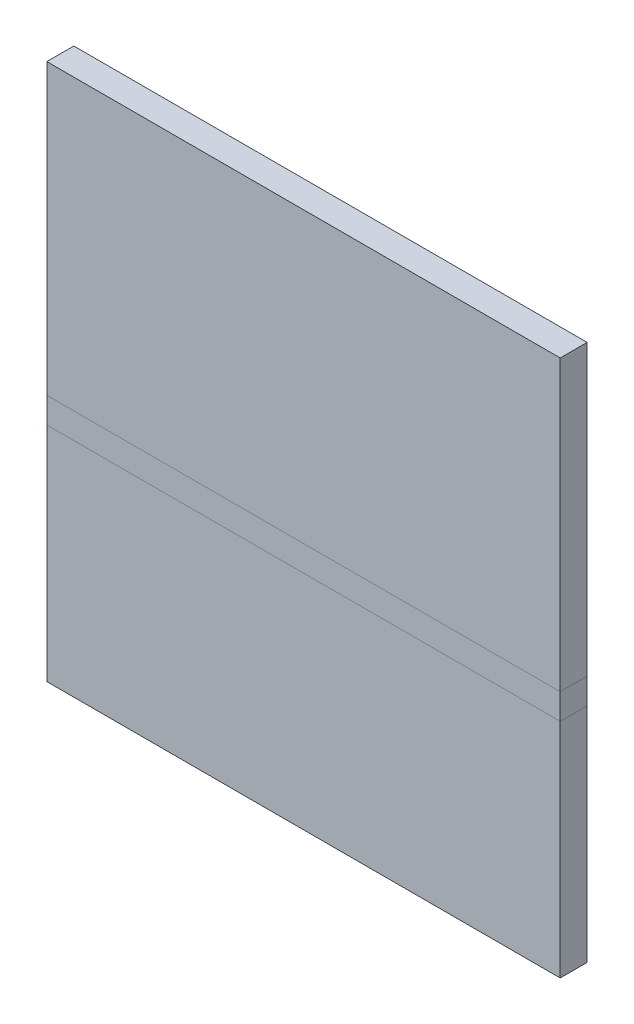
ISO-10303-21;
HEADER;
FILE_DESCRIPTION(('STEP AP214'),'2;1');
FILE_NAME('part.step','',(''),(''),'','','');
FILE_SCHEMA(('AUTOMOTIVE_DESIGN { 1 0 10303 214 1 1 1 1 }'));
ENDSEC;
DATA;
#1=APPLICATION_CONTEXT('core data for automotive mechanical design processes');
#2=APPLICATION_PROTOCOL_DEFINITION('international standard','automotive_design',2000,#1);
#3=PRODUCT_CONTEXT('',#1,'mechanical');
#4=PRODUCT('Part','Part','',(#3));
#5=PRODUCT_RELATED_PRODUCT_CATEGORY('part','',(#4));
#6=PRODUCT_DEFINITION_FORMATION('','',#4);
#7=PRODUCT_DEFINITION_CONTEXT('part definition',#1,'design');
#8=PRODUCT_DEFINITION('design','',#6,#7);
#9=PRODUCT_DEFINITION_SHAPE('','',#8);
#10=(LENGTH_UNIT() NAMED_UNIT(*) SI_UNIT(.MILLI.,.METRE.));
#11=(NAMED_UNIT(*) PLANE_ANGLE_UNIT() SI_UNIT($,.RADIAN.));
#12=(NAMED_UNIT(*) SI_UNIT($,.STERADIAN.) SOLID_ANGLE_UNIT());
#13=UNCERTAINTY_MEASURE_WITH_UNIT(LENGTH_MEASURE(1.E-05),#10,'distance_accuracy_value','');
#14=(GEOMETRIC_REPRESENTATION_CONTEXT(3) GLOBAL_UNCERTAINTY_ASSIGNED_CONTEXT((#13)) GLOBAL_UNIT_ASSIGNED_CONTEXT((#10,
#11,#12)) REPRESENTATION_CONTEXT('',''));
#15=CARTESIAN_POINT('',(0.,0.,0.));
#16=DIRECTION('',(0.,0.,1.));
#17=DIRECTION('',(1.,0.,0.));
#18=AXIS2_PLACEMENT_3D('',#15,#16,#17);
#19=CARTESIAN_POINT('',(0.,23.7993221294926,-2.667));
#20=DIRECTION('',(-1.,0.,0.));
#21=DIRECTION('',(0.,1.,0.));
#22=AXIS2_PLACEMENT_3D('',#19,#20,#21);
#23=PLANE('',#22);
#24=DIRECTION('',(0.,-1.,0.));
#25=VECTOR('',#24,1.);
#26=CARTESIAN_POINT('',(0.,23.7993221294926,-2.667));
#27=LINE('',#26,#25);
#28=CARTESIAN_POINT('',(0.,53.1363221294926,-2.6670000000002));
#29=VERTEX_POINT('',#28);
#30=CARTESIAN_POINT('',(0.,24.5359221294926,-2.667));
#31=VERTEX_POINT('',#30);
#32=EDGE_CURVE('E178',#29,#31,#27,.T.);
#33=ORIENTED_EDGE('',*,*,#32,.T.);
#34=DIRECTION('',(0.,0.,-1.));
#35=VECTOR('',#34,1.);
#36=CARTESIAN_POINT('',(0.,24.5359221294926,0.));
#37=LINE('',#36,#35);
#38=CARTESIAN_POINT('',(0.,24.5359221294926,0.));
#39=VERTEX_POINT('',#38);
#40=EDGE_CURVE('E13',#39,#31,#37,.T.);
#41=ORIENTED_EDGE('',*,*,#40,.F.);
#42=DIRECTION('',(0.,1.,0.));
#43=VECTOR('',#42,1.);
#44=CARTESIAN_POINT('',(0.,23.7993221294925,0.));
#45=LINE('',#44,#43);
#46=CARTESIAN_POINT('',(0.,53.1363221294926,-2.04697370165263E-13));
#47=VERTEX_POINT('',#46);
#48=EDGE_CURVE('E168',#47,#39,#45,.F.);
#49=ORIENTED_EDGE('',*,*,#48,.F.);
#50=DIRECTION('',(0.,0.,1.));
#51=VECTOR('',#50,1.);
#52=CARTESIAN_POINT('',(0.,53.1363221294926,-2.6670000000002));
#53=LINE('',#52,#51);
#54=EDGE_CURVE('E89',#29,#47,#53,.T.);
#55=ORIENTED_EDGE('',*,*,#54,.F.);
#56=EDGE_LOOP('',(#33,#41,#49,#55));
#57=FACE_BOUND('',#56,.T.);
#58=ADVANCED_FACE('F58',(#57),#23,.T.);
#59=CARTESIAN_POINT('',(50.8,53.1363221294926,-2.6670000000002));
#60=DIRECTION('',(1.,0.,0.));
#61=DIRECTION('',(0.,-1.,0.));
#62=AXIS2_PLACEMENT_3D('',#59,#60,#61);
#63=PLANE('',#62);
#64=DIRECTION('',(0.,-1.,0.));
#65=VECTOR('',#64,1.);
#66=CARTESIAN_POINT('',(50.8,23.7993221294925,0.));
#67=LINE('',#66,#65);
#68=CARTESIAN_POINT('',(50.8,24.5359221294926,0.));
#69=VERTEX_POINT('',#68);
#70=CARTESIAN_POINT('',(50.8,53.1363221294926,-2.04697370165263E-13));
#71=VERTEX_POINT('',#70);
#72=EDGE_CURVE('E96',#69,#71,#67,.F.);
#73=ORIENTED_EDGE('',*,*,#72,.F.);
#74=DIRECTION('',(0.,0.,-1.));
#75=VECTOR('',#74,1.);
#76=CARTESIAN_POINT('',(50.8,24.5359221294926,-2.667));
#77=LINE('',#76,#75);
#78=CARTESIAN_POINT('',(50.8,24.5359221294926,-2.667));
#79=VERTEX_POINT('',#78);
#80=EDGE_CURVE('E147',#69,#79,#77,.T.);
#81=ORIENTED_EDGE('',*,*,#80,.T.);
#82=DIRECTION('',(0.,1.,0.));
#83=VECTOR('',#82,1.);
#84=CARTESIAN_POINT('',(50.8,53.1363221294926,-2.6670000000002));
#85=LINE('',#84,#83);
#86=CARTESIAN_POINT('',(50.8,53.1363221294926,-2.6670000000002));
#87=VERTEX_POINT('',#86);
#88=EDGE_CURVE('E174',#79,#87,#85,.T.);
#89=ORIENTED_EDGE('',*,*,#88,.T.);
#90=DIRECTION('',(0.,0.,1.));
#91=VECTOR('',#90,1.);
#92=CARTESIAN_POINT('',(50.8,53.1363221294926,-2.6670000000002));
#93=LINE('',#92,#91);
#94=EDGE_CURVE('E161',#87,#71,#93,.T.);
#95=ORIENTED_EDGE('',*,*,#94,.T.);
#96=EDGE_LOOP('',(#73,#81,#89,#95));
#97=FACE_BOUND('',#96,.T.);
#98=ADVANCED_FACE('F60',(#97),#63,.T.);
#99=CARTESIAN_POINT('',(0.,23.7993221294925,-2.667));
#100=DIRECTION('',(0.,0.,-1.));
#101=DIRECTION('',(0.,1.,0.));
#102=AXIS2_PLACEMENT_3D('',#99,#100,#101);
#103=PLANE('',#102);
#104=ORIENTED_EDGE('',*,*,#88,.F.);
#105=DIRECTION('',(-1.,0.,0.));
#106=VECTOR('',#105,1.);
#107=CARTESIAN_POINT('',(0.,24.5359221294926,-2.667));
#108=LINE('',#107,#106);
#109=EDGE_CURVE('E133',#79,#31,#108,.T.);
#110=ORIENTED_EDGE('',*,*,#109,.T.);
#111=ORIENTED_EDGE('',*,*,#32,.F.);
#112=DIRECTION('',(-1.,0.,0.));
#113=VECTOR('',#112,1.);
#114=CARTESIAN_POINT('',(0.,53.1363221294926,-2.6670000000002));
#115=LINE('',#114,#113);
#116=EDGE_CURVE('E176',#87,#29,#115,.T.);
#117=ORIENTED_EDGE('',*,*,#116,.F.);
#118=EDGE_LOOP('',(#104,#110,#111,#117));
#119=FACE_BOUND('',#118,.T.);
#120=ADVANCED_FACE('F215',(#119),#103,.T.);
#121=CARTESIAN_POINT('',(0.,23.7993221294925,0.));
#122=DIRECTION('',(0.,0.,-1.));
#123=DIRECTION('',(0.,1.,0.));
#124=AXIS2_PLACEMENT_3D('',#121,#122,#123);
#125=PLANE('',#124);
#126=DIRECTION('',(-1.,0.,0.));
#127=VECTOR('',#126,1.);
#128=CARTESIAN_POINT('',(50.8,24.5359221294926,0.));
#129=LINE('',#128,#127);
#130=EDGE_CURVE('E67',#69,#39,#129,.T.);
#131=ORIENTED_EDGE('',*,*,#130,.F.);
#132=ORIENTED_EDGE('',*,*,#72,.T.);
#133=DIRECTION('',(1.,0.,0.));
#134=VECTOR('',#133,1.);
#135=CARTESIAN_POINT('',(0.,53.1363221294926,-2.04697370165263E-13));
#136=LINE('',#135,#134);
#137=EDGE_CURVE('E162',#71,#47,#136,.F.);
#138=ORIENTED_EDGE('',*,*,#137,.T.);
#139=ORIENTED_EDGE('',*,*,#48,.T.);
#140=EDGE_LOOP('',(#131,#132,#138,#139));
#141=FACE_BOUND('',#140,.T.);
#142=ADVANCED_FACE('F166',(#141),#125,.F.);
#143=CARTESIAN_POINT('',(0.,53.1363221294926,-2.6670000000002));
#144=DIRECTION('',(0.,1.,0.));
#145=DIRECTION('',(0.,0.,1.));
#146=AXIS2_PLACEMENT_3D('',#143,#144,#145);
#147=PLANE('',#146);
#148=ORIENTED_EDGE('',*,*,#137,.F.);
#149=ORIENTED_EDGE('',*,*,#94,.F.);
#150=ORIENTED_EDGE('',*,*,#116,.T.);
#151=ORIENTED_EDGE('',*,*,#54,.T.);
#152=EDGE_LOOP('',(#148,#149,#150,#151));
#153=FACE_BOUND('',#152,.T.);
#154=ADVANCED_FACE('F217',(#153),#147,.T.);
#155=CARTESIAN_POINT('',(0.,0.,-2.667));
#156=DIRECTION('',(0.,-1.,0.));
#157=DIRECTION('',(0.,0.,-1.));
#158=AXIS2_PLACEMENT_3D('',#155,#156,#157);
#159=PLANE('',#158);
#160=DIRECTION('',(1.,0.,0.));
#161=VECTOR('',#160,1.);
#162=CARTESIAN_POINT('',(0.,0.,0.));
#163=LINE('',#162,#161);
#164=CARTESIAN_POINT('',(0.,0.,0.));
#165=VERTEX_POINT('',#164);
#166=CARTESIAN_POINT('',(50.8,0.,0.));
#167=VERTEX_POINT('',#166);
#168=EDGE_CURVE('E196',#165,#167,#163,.T.);
#169=ORIENTED_EDGE('',*,*,#168,.F.);
#170=DIRECTION('',(0.,0.,1.));
#171=VECTOR('',#170,1.);
#172=CARTESIAN_POINT('',(0.,0.,-2.667));
#173=LINE('',#172,#171);
#174=CARTESIAN_POINT('',(0.,0.,-2.667));
#175=VERTEX_POINT('',#174);
#176=EDGE_CURVE('E163',#175,#165,#173,.T.);
#177=ORIENTED_EDGE('',*,*,#176,.F.);
#178=DIRECTION('',(1.,0.,0.));
#179=VECTOR('',#178,1.);
#180=CARTESIAN_POINT('',(0.,0.,-2.667));
#181=LINE('',#180,#179);
#182=CARTESIAN_POINT('',(50.8,0.,-2.667));
#183=VERTEX_POINT('',#182);
#184=EDGE_CURVE('E186',#175,#183,#181,.T.);
#185=ORIENTED_EDGE('',*,*,#184,.T.);
#186=DIRECTION('',(0.,0.,1.));
#187=VECTOR('',#186,1.);
#188=CARTESIAN_POINT('',(50.8,0.,-2.667));
#189=LINE('',#188,#187);
#190=EDGE_CURVE('E189',#183,#167,#189,.T.);
#191=ORIENTED_EDGE('',*,*,#190,.T.);
#192=EDGE_LOOP('',(#169,#177,#185,#191));
#193=FACE_BOUND('',#192,.T.);
#194=ADVANCED_FACE('F219',(#193),#159,.T.);
#195=CARTESIAN_POINT('',(0.,0.,-2.667));
#196=DIRECTION('',(0.,0.,-1.));
#197=DIRECTION('',(-1.,0.,0.));
#198=AXIS2_PLACEMENT_3D('',#195,#196,#197);
#199=PLANE('',#198);
#200=DIRECTION('',(0.,-1.,0.));
#201=VECTOR('',#200,1.);
#202=CARTESIAN_POINT('',(0.,0.,-2.667));
#203=LINE('',#202,#201);
#204=CARTESIAN_POINT('',(0.,21.9964,-2.667));
#205=VERTEX_POINT('',#204);
#206=EDGE_CURVE('E105',#205,#175,#203,.T.);
#207=ORIENTED_EDGE('',*,*,#206,.F.);
#208=DIRECTION('',(1.,0.,0.));
#209=VECTOR('',#208,1.);
#210=CARTESIAN_POINT('',(0.,21.9964,-2.667));
#211=LINE('',#210,#209);
#212=CARTESIAN_POINT('',(50.8,21.9964,-2.667));
#213=VERTEX_POINT('',#212);
#214=EDGE_CURVE('E191',#205,#213,#211,.T.);
#215=ORIENTED_EDGE('',*,*,#214,.T.);
#216=DIRECTION('',(0.,1.,0.));
#217=VECTOR('',#216,1.);
#218=CARTESIAN_POINT('',(50.8,0.,-2.667));
#219=LINE('',#218,#217);
#220=EDGE_CURVE('E193',#183,#213,#219,.T.);
#221=ORIENTED_EDGE('',*,*,#220,.F.);
#222=ORIENTED_EDGE('',*,*,#184,.F.);
#223=EDGE_LOOP('',(#207,#215,#221,#222));
#224=FACE_BOUND('',#223,.T.);
#225=ADVANCED_FACE('F224',(#224),#199,.T.);
#226=CARTESIAN_POINT('',(50.8,0.,-2.667));
#227=DIRECTION('',(1.,0.,0.));
#228=DIRECTION('',(0.,0.,-1.));
#229=AXIS2_PLACEMENT_3D('',#226,#227,#228);
#230=PLANE('',#229);
#231=DIRECTION('',(0.,0.,-1.));
#232=VECTOR('',#231,1.);
#233=CARTESIAN_POINT('',(50.8,21.9964,0.));
#234=LINE('',#233,#232);
#235=CARTESIAN_POINT('',(50.8,21.9964,0.));
#236=VERTEX_POINT('',#235);
#237=EDGE_CURVE('E184',#236,#213,#234,.T.);
#238=ORIENTED_EDGE('',*,*,#237,.F.);
#239=DIRECTION('',(0.,1.,0.));
#240=VECTOR('',#239,1.);
#241=CARTESIAN_POINT('',(50.8,0.,0.));
#242=LINE('',#241,#240);
#243=EDGE_CURVE('E199',#167,#236,#242,.T.);
#244=ORIENTED_EDGE('',*,*,#243,.F.);
#245=ORIENTED_EDGE('',*,*,#190,.F.);
#246=ORIENTED_EDGE('',*,*,#220,.T.);
#247=EDGE_LOOP('',(#238,#244,#245,#246));
#248=FACE_BOUND('',#247,.T.);
#249=ADVANCED_FACE('F242',(#248),#230,.T.);
#250=CARTESIAN_POINT('',(0.,0.,0.));
#251=DIRECTION('',(0.,0.,-1.));
#252=DIRECTION('',(-1.,0.,0.));
#253=AXIS2_PLACEMENT_3D('',#250,#251,#252);
#254=PLANE('',#253);
#255=DIRECTION('',(1.,0.,0.));
#256=VECTOR('',#255,1.);
#257=CARTESIAN_POINT('',(0.,21.9964,0.));
#258=LINE('',#257,#256);
#259=CARTESIAN_POINT('',(0.,21.9964,0.));
#260=VERTEX_POINT('',#259);
#261=EDGE_CURVE('E157',#260,#236,#258,.T.);
#262=ORIENTED_EDGE('',*,*,#261,.F.);
#263=DIRECTION('',(0.,-1.,0.));
#264=VECTOR('',#263,1.);
#265=CARTESIAN_POINT('',(0.,0.,0.));
#266=LINE('',#265,#264);
#267=EDGE_CURVE('E123',#260,#165,#266,.T.);
#268=ORIENTED_EDGE('',*,*,#267,.T.);
#269=ORIENTED_EDGE('',*,*,#168,.T.);
#270=ORIENTED_EDGE('',*,*,#243,.T.);
#271=EDGE_LOOP('',(#262,#268,#269,#270));
#272=FACE_BOUND('',#271,.T.);
#273=ADVANCED_FACE('F239',(#272),#254,.F.);
#274=CARTESIAN_POINT('',(0.,0.,-2.667));
#275=DIRECTION('',(-1.,0.,0.));
#276=DIRECTION('',(0.,0.,1.));
#277=AXIS2_PLACEMENT_3D('',#274,#275,#276);
#278=PLANE('',#277);
#279=ORIENTED_EDGE('',*,*,#267,.F.);
#280=DIRECTION('',(0.,0.,-1.));
#281=VECTOR('',#280,1.);
#282=CARTESIAN_POINT('',(0.,21.9964,0.));
#283=LINE('',#282,#281);
#284=EDGE_CURVE('E201',#260,#205,#283,.T.);
#285=ORIENTED_EDGE('',*,*,#284,.T.);
#286=ORIENTED_EDGE('',*,*,#206,.T.);
#287=ORIENTED_EDGE('',*,*,#176,.T.);
#288=EDGE_LOOP('',(#279,#285,#286,#287));
#289=FACE_BOUND('',#288,.T.);
#290=ADVANCED_FACE('F236',(#289),#278,.T.);
#291=CARTESIAN_POINT('',(0.,24.5359221294926,-2.667));
#292=DIRECTION('',(-1.,0.,0.));
#293=DIRECTION('',(0.,1.,0.));
#294=AXIS2_PLACEMENT_3D('',#291,#292,#293);
#295=PLANE('',#294);
#296=ORIENTED_EDGE('',*,*,#284,.F.);
#297=DIRECTION('',(0.,1.,0.));
#298=VECTOR('',#297,1.);
#299=CARTESIAN_POINT('',(0.,23.2661610647463,0.));
#300=LINE('',#299,#298);
#301=EDGE_CURVE('E158',#260,#39,#300,.T.);
#302=ORIENTED_EDGE('',*,*,#301,.T.);
#303=ORIENTED_EDGE('',*,*,#40,.T.);
#304=DIRECTION('',(0.,1.,0.));
#305=VECTOR('',#304,1.);
#306=CARTESIAN_POINT('',(0.,24.5359221294926,-2.667));
#307=LINE('',#306,#305);
#308=EDGE_CURVE('E75',#205,#31,#307,.T.);
#309=ORIENTED_EDGE('',*,*,#308,.F.);
#310=EDGE_LOOP('',(#296,#302,#303,#309));
#311=FACE_BOUND('',#310,.T.);
#312=ADVANCED_FACE('F211',(#311),#295,.T.);
#313=CARTESIAN_POINT('',(50.8,21.9964,-2.667));
#314=DIRECTION('',(1.,0.,0.));
#315=DIRECTION('',(0.,-1.,0.));
#316=AXIS2_PLACEMENT_3D('',#313,#314,#315);
#317=PLANE('',#316);
#318=DIRECTION('',(0.,1.,0.));
#319=VECTOR('',#318,1.);
#320=CARTESIAN_POINT('',(50.8,23.2661610647463,0.));
#321=LINE('',#320,#319);
#322=EDGE_CURVE('E150',#69,#236,#321,.F.);
#323=ORIENTED_EDGE('',*,*,#322,.T.);
#324=ORIENTED_EDGE('',*,*,#237,.T.);
#325=DIRECTION('',(0.,-1.,0.));
#326=VECTOR('',#325,1.);
#327=CARTESIAN_POINT('',(50.8,21.9964,-2.667));
#328=LINE('',#327,#326);
#329=EDGE_CURVE('E151',#79,#213,#328,.T.);
#330=ORIENTED_EDGE('',*,*,#329,.F.);
#331=ORIENTED_EDGE('',*,*,#80,.F.);
#332=EDGE_LOOP('',(#323,#324,#330,#331));
#333=FACE_BOUND('',#332,.T.);
#334=ADVANCED_FACE('F148',(#333),#317,.T.);
#335=CARTESIAN_POINT('',(25.4,23.2661610647463,-2.667));
#336=DIRECTION('',(0.,0.,-1.));
#337=DIRECTION('',(-1.,0.,0.));
#338=AXIS2_PLACEMENT_3D('',#335,#336,#337);
#339=PLANE('',#338);
#340=ORIENTED_EDGE('',*,*,#109,.F.);
#341=ORIENTED_EDGE('',*,*,#329,.T.);
#342=ORIENTED_EDGE('',*,*,#214,.F.);
#343=ORIENTED_EDGE('',*,*,#308,.T.);
#344=EDGE_LOOP('',(#340,#341,#342,#343));
#345=FACE_BOUND('',#344,.T.);
#346=ADVANCED_FACE('F207',(#345),#339,.T.);
#347=CARTESIAN_POINT('',(25.4,23.2661610647463,0.));
#348=DIRECTION('',(0.,0.,-1.));
#349=DIRECTION('',(-1.,0.,0.));
#350=AXIS2_PLACEMENT_3D('',#347,#348,#349);
#351=PLANE('',#350);
#352=ORIENTED_EDGE('',*,*,#130,.T.);
#353=ORIENTED_EDGE('',*,*,#301,.F.);
#354=ORIENTED_EDGE('',*,*,#261,.T.);
#355=ORIENTED_EDGE('',*,*,#322,.F.);
#356=EDGE_LOOP('',(#352,#353,#354,#355));
#357=FACE_BOUND('',#356,.T.);
#358=ADVANCED_FACE('F156',(#357),#351,.F.);
#359=CLOSED_SHELL('',(#58,#98,#120,#142,#154,#194,#225,#249,#273,#290,#312,#334,#346,#358));
#360=MANIFOLD_SOLID_BREP('B2',#359);
#361=ADVANCED_BREP_SHAPE_REPRESENTATION('',(#18,#360),#14);
#362=SHAPE_DEFINITION_REPRESENTATION(#9,#361);
ENDSEC;
END-ISO-10303-21;
